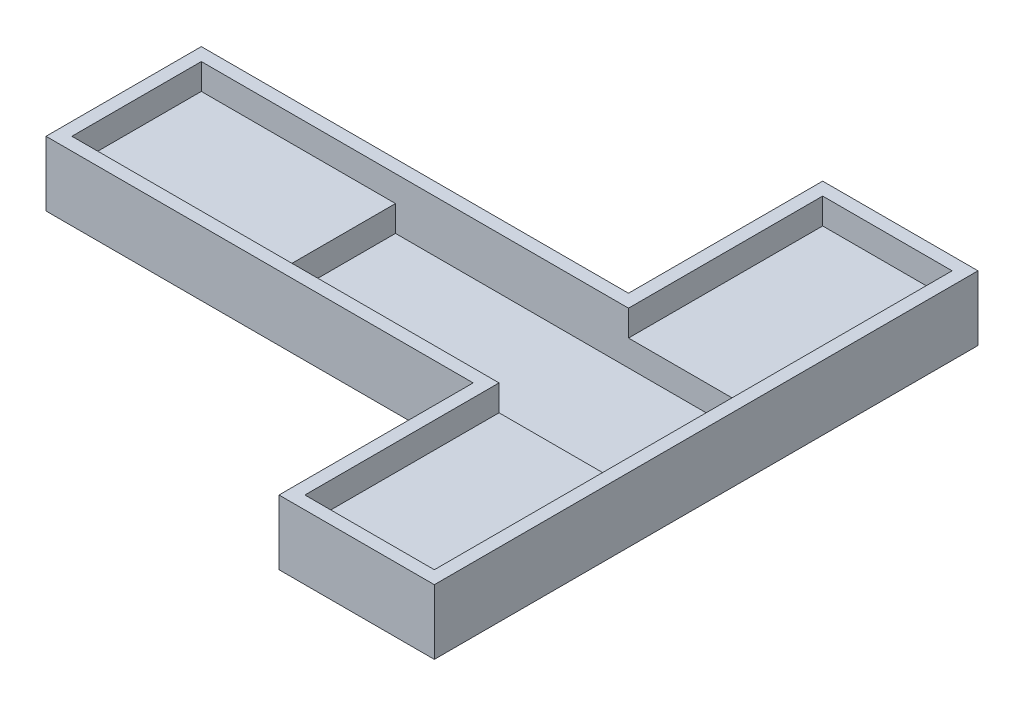
ISO-10303-21;
HEADER;
FILE_DESCRIPTION(('STEP AP214'),'2;1');
FILE_NAME('part.step','',(''),(''),'','','');
FILE_SCHEMA(('AUTOMOTIVE_DESIGN { 1 0 10303 214 1 1 1 1 }'));
ENDSEC;
DATA;
#1=APPLICATION_CONTEXT('core data for automotive mechanical design processes');
#2=APPLICATION_PROTOCOL_DEFINITION('international standard','automotive_design',2000,#1);
#3=PRODUCT_CONTEXT('',#1,'mechanical');
#4=PRODUCT('Part','Part','',(#3));
#5=PRODUCT_RELATED_PRODUCT_CATEGORY('part','',(#4));
#6=PRODUCT_DEFINITION_FORMATION('','',#4);
#7=PRODUCT_DEFINITION_CONTEXT('part definition',#1,'design');
#8=PRODUCT_DEFINITION('design','',#6,#7);
#9=PRODUCT_DEFINITION_SHAPE('','',#8);
#10=(LENGTH_UNIT() NAMED_UNIT(*) SI_UNIT(.MILLI.,.METRE.));
#11=(NAMED_UNIT(*) PLANE_ANGLE_UNIT() SI_UNIT($,.RADIAN.));
#12=(NAMED_UNIT(*) SI_UNIT($,.STERADIAN.) SOLID_ANGLE_UNIT());
#13=UNCERTAINTY_MEASURE_WITH_UNIT(LENGTH_MEASURE(1.E-05),#10,'distance_accuracy_value','');
#14=(GEOMETRIC_REPRESENTATION_CONTEXT(3) GLOBAL_UNCERTAINTY_ASSIGNED_CONTEXT((#13)) GLOBAL_UNIT_ASSIGNED_CONTEXT((#10,
#11,#12)) REPRESENTATION_CONTEXT('',''));
#15=CARTESIAN_POINT('',(0.,0.,0.));
#16=DIRECTION('',(0.,0.,1.));
#17=DIRECTION('',(1.,0.,0.));
#18=AXIS2_PLACEMENT_3D('',#15,#16,#17);
#19=CARTESIAN_POINT('',(0.,1.,0.));
#20=DIRECTION('',(0.,1.,0.));
#21=DIRECTION('',(0.,0.,1.));
#22=AXIS2_PLACEMENT_3D('',#19,#20,#21);
#23=PLANE('',#22);
#24=DIRECTION('',(1.,0.,0.));
#25=VECTOR('',#24,1.);
#26=CARTESIAN_POINT('',(0.,1.,5.));
#27=LINE('',#26,#25);
#28=CARTESIAN_POINT('',(-14.,1.,5.));
#29=VERTEX_POINT('',#28);
#30=CARTESIAN_POINT('',(14.,1.,5.));
#31=VERTEX_POINT('',#30);
#32=EDGE_CURVE('E11',#29,#31,#27,.T.);
#33=ORIENTED_EDGE('',*,*,#32,.T.);
#34=DIRECTION('',(0.,0.,1.));
#35=VECTOR('',#34,1.);
#36=CARTESIAN_POINT('',(14.,1.,0.));
#37=LINE('',#36,#35);
#38=CARTESIAN_POINT('',(14.,1.,-5.));
#39=VERTEX_POINT('',#38);
#40=EDGE_CURVE('E236',#39,#31,#37,.T.);
#41=ORIENTED_EDGE('',*,*,#40,.F.);
#42=DIRECTION('',(1.,0.,0.));
#43=VECTOR('',#42,1.);
#44=CARTESIAN_POINT('',(0.,1.,-4.99999999999999));
#45=LINE('',#44,#43);
#46=CARTESIAN_POINT('',(-14.,1.,-4.99999999999999));
#47=VERTEX_POINT('',#46);
#48=EDGE_CURVE('E45',#47,#39,#45,.T.);
#49=ORIENTED_EDGE('',*,*,#48,.F.);
#50=DIRECTION('',(0.,0.,-1.));
#51=VECTOR('',#50,1.);
#52=CARTESIAN_POINT('',(-14.,1.,-4.99999999999999));
#53=LINE('',#52,#51);
#54=EDGE_CURVE('E269',#29,#47,#53,.T.);
#55=ORIENTED_EDGE('',*,*,#54,.F.);
#56=EDGE_LOOP('',(#33,#41,#49,#55));
#57=FACE_BOUND('',#56,.T.);
#58=ADVANCED_FACE('F37',(#57),#23,.T.);
#59=CARTESIAN_POINT('',(14.,0.,20.));
#60=DIRECTION('',(1.,0.,0.));
#61=DIRECTION('',(0.,0.,-1.));
#62=AXIS2_PLACEMENT_3D('',#59,#60,#61);
#63=PLANE('',#62);
#64=DIRECTION('',(0.,-1.,0.));
#65=VECTOR('',#64,1.);
#66=CARTESIAN_POINT('',(14.,3.,5.));
#67=LINE('',#66,#65);
#68=CARTESIAN_POINT('',(14.,3.,5.));
#69=VERTEX_POINT('',#68);
#70=EDGE_CURVE('E276',#69,#31,#67,.T.);
#71=ORIENTED_EDGE('',*,*,#70,.F.);
#72=DIRECTION('',(0.,0.,-1.));
#73=VECTOR('',#72,1.);
#74=CARTESIAN_POINT('',(14.,3.,5.));
#75=LINE('',#74,#73);
#76=CARTESIAN_POINT('',(14.,3.,20.));
#77=VERTEX_POINT('',#76);
#78=EDGE_CURVE('E186',#77,#69,#75,.T.);
#79=ORIENTED_EDGE('',*,*,#78,.F.);
#80=DIRECTION('',(0.,1.,0.));
#81=VECTOR('',#80,1.);
#82=CARTESIAN_POINT('',(14.,0.,20.));
#83=LINE('',#82,#81);
#84=CARTESIAN_POINT('',(14.,5.,20.));
#85=VERTEX_POINT('',#84);
#86=EDGE_CURVE('E185',#77,#85,#83,.T.);
#87=ORIENTED_EDGE('',*,*,#86,.T.);
#88=DIRECTION('',(0.,0.,-1.));
#89=VECTOR('',#88,1.);
#90=CARTESIAN_POINT('',(14.,5.,20.));
#91=LINE('',#90,#89);
#92=CARTESIAN_POINT('',(14.,5.,-20.));
#93=VERTEX_POINT('',#92);
#94=EDGE_CURVE('E305',#85,#93,#91,.T.);
#95=ORIENTED_EDGE('',*,*,#94,.T.);
#96=DIRECTION('',(0.,1.,0.));
#97=VECTOR('',#96,1.);
#98=CARTESIAN_POINT('',(14.,0.,-20.));
#99=LINE('',#98,#97);
#100=CARTESIAN_POINT('',(14.,3.,-20.));
#101=VERTEX_POINT('',#100);
#102=EDGE_CURVE('E210',#101,#93,#99,.T.);
#103=ORIENTED_EDGE('',*,*,#102,.F.);
#104=DIRECTION('',(0.,0.,-1.));
#105=VECTOR('',#104,1.);
#106=CARTESIAN_POINT('',(14.,3.,-5.));
#107=LINE('',#106,#105);
#108=CARTESIAN_POINT('',(14.,3.,-5.));
#109=VERTEX_POINT('',#108);
#110=EDGE_CURVE('E267',#109,#101,#107,.T.);
#111=ORIENTED_EDGE('',*,*,#110,.F.);
#112=DIRECTION('',(0.,-1.,0.));
#113=VECTOR('',#112,1.);
#114=CARTESIAN_POINT('',(14.,3.,-5.));
#115=LINE('',#114,#113);
#116=EDGE_CURVE('E257',#109,#39,#115,.T.);
#117=ORIENTED_EDGE('',*,*,#116,.T.);
#118=ORIENTED_EDGE('',*,*,#40,.T.);
#119=EDGE_LOOP('',(#71,#79,#87,#95,#103,#111,#117,#118));
#120=FACE_BOUND('',#119,.T.);
#121=ADVANCED_FACE('F265',(#120),#63,.F.);
#122=CARTESIAN_POINT('',(3.99999999999999,0.,-20.));
#123=DIRECTION('',(-1.,0.,0.));
#124=DIRECTION('',(0.,0.,1.));
#125=AXIS2_PLACEMENT_3D('',#122,#123,#124);
#126=PLANE('',#125);
#127=DIRECTION('',(0.,0.,1.));
#128=VECTOR('',#127,1.);
#129=CARTESIAN_POINT('',(3.99999999999999,3.,-5.));
#130=LINE('',#129,#128);
#131=CARTESIAN_POINT('',(3.99999999999999,3.,-20.));
#132=VERTEX_POINT('',#131);
#133=CARTESIAN_POINT('',(3.99999999999999,3.,-4.99999999999999));
#134=VERTEX_POINT('',#133);
#135=EDGE_CURVE('E278',#132,#134,#130,.T.);
#136=ORIENTED_EDGE('',*,*,#135,.F.);
#137=DIRECTION('',(0.,1.,0.));
#138=VECTOR('',#137,1.);
#139=CARTESIAN_POINT('',(3.99999999999999,0.,-20.));
#140=LINE('',#139,#138);
#141=CARTESIAN_POINT('',(3.99999999999999,5.,-20.));
#142=VERTEX_POINT('',#141);
#143=EDGE_CURVE('E208',#132,#142,#140,.T.);
#144=ORIENTED_EDGE('',*,*,#143,.T.);
#145=DIRECTION('',(0.,0.,1.));
#146=VECTOR('',#145,1.);
#147=CARTESIAN_POINT('',(3.99999999999999,5.,-20.));
#148=LINE('',#147,#146);
#149=CARTESIAN_POINT('',(3.99999999999999,5.,-4.99999999999999));
#150=VERTEX_POINT('',#149);
#151=EDGE_CURVE('E311',#142,#150,#148,.T.);
#152=ORIENTED_EDGE('',*,*,#151,.T.);
#153=DIRECTION('',(0.,1.,0.));
#154=VECTOR('',#153,1.);
#155=CARTESIAN_POINT('',(3.99999999999999,0.,-4.99999999999999));
#156=LINE('',#155,#154);
#157=EDGE_CURVE('E60',#134,#150,#156,.T.);
#158=ORIENTED_EDGE('',*,*,#157,.F.);
#159=EDGE_LOOP('',(#136,#144,#152,#158));
#160=FACE_BOUND('',#159,.T.);
#161=ADVANCED_FACE('F392',(#160),#126,.F.);
#162=CARTESIAN_POINT('',(14.,0.,-20.));
#163=DIRECTION('',(0.,0.,-1.));
#164=DIRECTION('',(-1.,0.,0.));
#165=AXIS2_PLACEMENT_3D('',#162,#163,#164);
#166=PLANE('',#165);
#167=DIRECTION('',(-1.,0.,0.));
#168=VECTOR('',#167,1.);
#169=CARTESIAN_POINT('',(3.99999999999999,3.,-20.));
#170=LINE('',#169,#168);
#171=EDGE_CURVE('E270',#101,#132,#170,.T.);
#172=ORIENTED_EDGE('',*,*,#171,.F.);
#173=ORIENTED_EDGE('',*,*,#102,.T.);
#174=DIRECTION('',(-1.,0.,0.));
#175=VECTOR('',#174,1.);
#176=CARTESIAN_POINT('',(14.,5.,-20.));
#177=LINE('',#176,#175);
#178=EDGE_CURVE('E308',#93,#142,#177,.T.);
#179=ORIENTED_EDGE('',*,*,#178,.T.);
#180=ORIENTED_EDGE('',*,*,#143,.F.);
#181=EDGE_LOOP('',(#172,#173,#179,#180));
#182=FACE_BOUND('',#181,.T.);
#183=ADVANCED_FACE('F511',(#182),#166,.F.);
#184=CARTESIAN_POINT('',(-29.,0.,5.));
#185=DIRECTION('',(0.,0.,1.));
#186=DIRECTION('',(1.,0.,0.));
#187=AXIS2_PLACEMENT_3D('',#184,#185,#186);
#188=PLANE('',#187);
#189=DIRECTION('',(0.,-1.,0.));
#190=VECTOR('',#189,1.);
#191=CARTESIAN_POINT('',(-14.,3.,5.));
#192=LINE('',#191,#190);
#193=CARTESIAN_POINT('',(-14.,3.,5.));
#194=VERTEX_POINT('',#193);
#195=EDGE_CURVE('E301',#194,#29,#192,.T.);
#196=ORIENTED_EDGE('',*,*,#195,.F.);
#197=DIRECTION('',(1.,0.,0.));
#198=VECTOR('',#197,1.);
#199=CARTESIAN_POINT('',(-29.,3.,5.));
#200=LINE('',#199,#198);
#201=CARTESIAN_POINT('',(-29.,3.,5.));
#202=VERTEX_POINT('',#201);
#203=EDGE_CURVE('E292',#202,#194,#200,.T.);
#204=ORIENTED_EDGE('',*,*,#203,.F.);
#205=DIRECTION('',(0.,1.,0.));
#206=VECTOR('',#205,1.);
#207=CARTESIAN_POINT('',(-29.,0.,5.));
#208=LINE('',#207,#206);
#209=CARTESIAN_POINT('',(-29.,5.,5.));
#210=VERTEX_POINT('',#209);
#211=EDGE_CURVE('E198',#202,#210,#208,.T.);
#212=ORIENTED_EDGE('',*,*,#211,.T.);
#213=DIRECTION('',(1.,0.,0.));
#214=VECTOR('',#213,1.);
#215=CARTESIAN_POINT('',(-29.,5.,5.));
#216=LINE('',#215,#214);
#217=CARTESIAN_POINT('',(3.99999999999999,5.,5.));
#218=VERTEX_POINT('',#217);
#219=EDGE_CURVE('E319',#210,#218,#216,.T.);
#220=ORIENTED_EDGE('',*,*,#219,.T.);
#221=DIRECTION('',(0.,1.,0.));
#222=VECTOR('',#221,1.);
#223=CARTESIAN_POINT('',(3.99999999999999,0.,5.));
#224=LINE('',#223,#222);
#225=CARTESIAN_POINT('',(3.99999999999999,3.,5.));
#226=VERTEX_POINT('',#225);
#227=EDGE_CURVE('E193',#226,#218,#224,.T.);
#228=ORIENTED_EDGE('',*,*,#227,.F.);
#229=DIRECTION('',(-1.,0.,0.));
#230=VECTOR('',#229,1.);
#231=CARTESIAN_POINT('',(3.99999999999999,3.,5.));
#232=LINE('',#231,#230);
#233=EDGE_CURVE('E52',#69,#226,#232,.T.);
#234=ORIENTED_EDGE('',*,*,#233,.F.);
#235=ORIENTED_EDGE('',*,*,#70,.T.);
#236=ORIENTED_EDGE('',*,*,#32,.F.);
#237=EDGE_LOOP('',(#196,#204,#212,#220,#228,#234,#235,#236));
#238=FACE_BOUND('',#237,.T.);
#239=ADVANCED_FACE('F277',(#238),#188,.F.);
#240=CARTESIAN_POINT('',(3.99999999999999,0.,-4.99999999999999));
#241=DIRECTION('',(0.,0.,-1.));
#242=DIRECTION('',(-1.,0.,0.));
#243=AXIS2_PLACEMENT_3D('',#240,#241,#242);
#244=PLANE('',#243);
#245=DIRECTION('',(0.,-1.,0.));
#246=VECTOR('',#245,1.);
#247=CARTESIAN_POINT('',(-14.,3.,-4.99999999999999));
#248=LINE('',#247,#246);
#249=CARTESIAN_POINT('',(-14.,3.,-4.99999999999999));
#250=VERTEX_POINT('',#249);
#251=EDGE_CURVE('E259',#250,#47,#248,.T.);
#252=ORIENTED_EDGE('',*,*,#251,.T.);
#253=ORIENTED_EDGE('',*,*,#48,.T.);
#254=ORIENTED_EDGE('',*,*,#116,.F.);
#255=DIRECTION('',(1.,0.,0.));
#256=VECTOR('',#255,1.);
#257=CARTESIAN_POINT('',(3.99999999999999,3.,-5.));
#258=LINE('',#257,#256);
#259=EDGE_CURVE('E281',#134,#109,#258,.T.);
#260=ORIENTED_EDGE('',*,*,#259,.F.);
#261=ORIENTED_EDGE('',*,*,#157,.T.);
#262=DIRECTION('',(-1.,0.,0.));
#263=VECTOR('',#262,1.);
#264=CARTESIAN_POINT('',(3.99999999999999,5.,-4.99999999999999));
#265=LINE('',#264,#263);
#266=CARTESIAN_POINT('',(-29.,5.,-4.99999999999999));
#267=VERTEX_POINT('',#266);
#268=EDGE_CURVE('E313',#150,#267,#265,.T.);
#269=ORIENTED_EDGE('',*,*,#268,.T.);
#270=DIRECTION('',(0.,1.,0.));
#271=VECTOR('',#270,1.);
#272=CARTESIAN_POINT('',(-29.,0.,-4.99999999999999));
#273=LINE('',#272,#271);
#274=CARTESIAN_POINT('',(-29.,3.,-4.99999999999999));
#275=VERTEX_POINT('',#274);
#276=EDGE_CURVE('E205',#275,#267,#273,.T.);
#277=ORIENTED_EDGE('',*,*,#276,.F.);
#278=DIRECTION('',(-1.,0.,0.));
#279=VECTOR('',#278,1.);
#280=CARTESIAN_POINT('',(-29.,3.,-4.99999999999999));
#281=LINE('',#280,#279);
#282=EDGE_CURVE('E297',#250,#275,#281,.T.);
#283=ORIENTED_EDGE('',*,*,#282,.F.);
#284=EDGE_LOOP('',(#252,#253,#254,#260,#261,#269,#277,#283));
#285=FACE_BOUND('',#284,.T.);
#286=ADVANCED_FACE('F256',(#285),#244,.F.);
#287=CARTESIAN_POINT('',(2.99999999999999,0.,21.));
#288=DIRECTION('',(0.,0.,1.));
#289=DIRECTION('',(1.,0.,0.));
#290=AXIS2_PLACEMENT_3D('',#287,#288,#289);
#291=PLANE('',#290);
#292=DIRECTION('',(0.,1.,0.));
#293=VECTOR('',#292,1.);
#294=CARTESIAN_POINT('',(15.,0.,21.));
#295=LINE('',#294,#293);
#296=CARTESIAN_POINT('',(15.,0.,21.));
#297=VERTEX_POINT('',#296);
#298=CARTESIAN_POINT('',(15.,5.,21.));
#299=VERTEX_POINT('',#298);
#300=EDGE_CURVE('E233',#297,#299,#295,.T.);
#301=ORIENTED_EDGE('',*,*,#300,.T.);
#302=DIRECTION('',(1.,0.,0.));
#303=VECTOR('',#302,1.);
#304=CARTESIAN_POINT('',(2.99999999999999,5.,21.));
#305=LINE('',#304,#303);
#306=CARTESIAN_POINT('',(2.99999999999999,5.,21.));
#307=VERTEX_POINT('',#306);
#308=EDGE_CURVE('E323',#307,#299,#305,.T.);
#309=ORIENTED_EDGE('',*,*,#308,.F.);
#310=DIRECTION('',(0.,1.,0.));
#311=VECTOR('',#310,1.);
#312=CARTESIAN_POINT('',(2.99999999999999,0.,21.));
#313=LINE('',#312,#311);
#314=CARTESIAN_POINT('',(2.99999999999999,0.,21.));
#315=VERTEX_POINT('',#314);
#316=EDGE_CURVE('E234',#315,#307,#313,.T.);
#317=ORIENTED_EDGE('',*,*,#316,.F.);
#318=DIRECTION('',(1.,0.,0.));
#319=VECTOR('',#318,1.);
#320=CARTESIAN_POINT('',(2.99999999999999,0.,21.));
#321=LINE('',#320,#319);
#322=EDGE_CURVE('E192',#315,#297,#321,.T.);
#323=ORIENTED_EDGE('',*,*,#322,.T.);
#324=EDGE_LOOP('',(#301,#309,#317,#323));
#325=FACE_BOUND('',#324,.T.);
#326=ADVANCED_FACE('F351',(#325),#291,.T.);
#327=CARTESIAN_POINT('',(2.99999999999999,0.,6.));
#328=DIRECTION('',(-1.,0.,0.));
#329=DIRECTION('',(0.,0.,1.));
#330=AXIS2_PLACEMENT_3D('',#327,#328,#329);
#331=PLANE('',#330);
#332=ORIENTED_EDGE('',*,*,#316,.T.);
#333=DIRECTION('',(0.,0.,1.));
#334=VECTOR('',#333,1.);
#335=CARTESIAN_POINT('',(2.99999999999999,5.,6.));
#336=LINE('',#335,#334);
#337=CARTESIAN_POINT('',(2.99999999999999,5.,6.));
#338=VERTEX_POINT('',#337);
#339=EDGE_CURVE('E201',#338,#307,#336,.T.);
#340=ORIENTED_EDGE('',*,*,#339,.F.);
#341=DIRECTION('',(0.,1.,0.));
#342=VECTOR('',#341,1.);
#343=CARTESIAN_POINT('',(2.99999999999999,0.,6.));
#344=LINE('',#343,#342);
#345=CARTESIAN_POINT('',(2.99999999999999,0.,6.));
#346=VERTEX_POINT('',#345);
#347=EDGE_CURVE('E237',#346,#338,#344,.T.);
#348=ORIENTED_EDGE('',*,*,#347,.F.);
#349=DIRECTION('',(0.,0.,1.));
#350=VECTOR('',#349,1.);
#351=CARTESIAN_POINT('',(2.99999999999999,0.,6.));
#352=LINE('',#351,#350);
#353=EDGE_CURVE('E230',#346,#315,#352,.T.);
#354=ORIENTED_EDGE('',*,*,#353,.T.);
#355=EDGE_LOOP('',(#332,#340,#348,#354));
#356=FACE_BOUND('',#355,.T.);
#357=ADVANCED_FACE('F378',(#356),#331,.T.);
#358=CARTESIAN_POINT('',(-30.,0.,6.));
#359=DIRECTION('',(0.,0.,1.));
#360=DIRECTION('',(1.,0.,0.));
#361=AXIS2_PLACEMENT_3D('',#358,#359,#360);
#362=PLANE('',#361);
#363=ORIENTED_EDGE('',*,*,#347,.T.);
#364=DIRECTION('',(1.,0.,0.));
#365=VECTOR('',#364,1.);
#366=CARTESIAN_POINT('',(-30.,5.,6.));
#367=LINE('',#366,#365);
#368=CARTESIAN_POINT('',(-30.,5.,6.));
#369=VERTEX_POINT('',#368);
#370=EDGE_CURVE('E340',#369,#338,#367,.T.);
#371=ORIENTED_EDGE('',*,*,#370,.F.);
#372=DIRECTION('',(0.,1.,0.));
#373=VECTOR('',#372,1.);
#374=CARTESIAN_POINT('',(-30.,0.,6.));
#375=LINE('',#374,#373);
#376=CARTESIAN_POINT('',(-30.,0.,6.));
#377=VERTEX_POINT('',#376);
#378=EDGE_CURVE('E239',#377,#369,#375,.T.);
#379=ORIENTED_EDGE('',*,*,#378,.F.);
#380=DIRECTION('',(1.,0.,0.));
#381=VECTOR('',#380,1.);
#382=CARTESIAN_POINT('',(-30.,0.,6.));
#383=LINE('',#382,#381);
#384=EDGE_CURVE('E227',#377,#346,#383,.T.);
#385=ORIENTED_EDGE('',*,*,#384,.T.);
#386=EDGE_LOOP('',(#363,#371,#379,#385));
#387=FACE_BOUND('',#386,.T.);
#388=ADVANCED_FACE('F376',(#387),#362,.T.);
#389=CARTESIAN_POINT('',(-30.,0.,-5.99999999999999));
#390=DIRECTION('',(-1.,0.,0.));
#391=DIRECTION('',(0.,0.,1.));
#392=AXIS2_PLACEMENT_3D('',#389,#390,#391);
#393=PLANE('',#392);
#394=ORIENTED_EDGE('',*,*,#378,.T.);
#395=DIRECTION('',(0.,0.,1.));
#396=VECTOR('',#395,1.);
#397=CARTESIAN_POINT('',(-30.,5.,-5.99999999999999));
#398=LINE('',#397,#396);
#399=CARTESIAN_POINT('',(-30.,5.,-5.99999999999999));
#400=VERTEX_POINT('',#399);
#401=EDGE_CURVE('E338',#400,#369,#398,.T.);
#402=ORIENTED_EDGE('',*,*,#401,.F.);
#403=DIRECTION('',(0.,1.,0.));
#404=VECTOR('',#403,1.);
#405=CARTESIAN_POINT('',(-30.,0.,-5.99999999999999));
#406=LINE('',#405,#404);
#407=CARTESIAN_POINT('',(-30.,0.,-5.99999999999999));
#408=VERTEX_POINT('',#407);
#409=EDGE_CURVE('E241',#408,#400,#406,.T.);
#410=ORIENTED_EDGE('',*,*,#409,.F.);
#411=DIRECTION('',(0.,0.,1.));
#412=VECTOR('',#411,1.);
#413=CARTESIAN_POINT('',(-30.,0.,-5.99999999999999));
#414=LINE('',#413,#412);
#415=EDGE_CURVE('E224',#408,#377,#414,.T.);
#416=ORIENTED_EDGE('',*,*,#415,.T.);
#417=EDGE_LOOP('',(#394,#402,#410,#416));
#418=FACE_BOUND('',#417,.T.);
#419=ADVANCED_FACE('F374',(#418),#393,.T.);
#420=CARTESIAN_POINT('',(2.99999999999999,0.,-5.99999999999999));
#421=DIRECTION('',(0.,0.,-1.));
#422=DIRECTION('',(-1.,0.,0.));
#423=AXIS2_PLACEMENT_3D('',#420,#421,#422);
#424=PLANE('',#423);
#425=ORIENTED_EDGE('',*,*,#409,.T.);
#426=DIRECTION('',(-1.,0.,0.));
#427=VECTOR('',#426,1.);
#428=CARTESIAN_POINT('',(2.99999999999999,5.,-5.99999999999999));
#429=LINE('',#428,#427);
#430=CARTESIAN_POINT('',(2.99999999999999,5.,-5.99999999999999));
#431=VERTEX_POINT('',#430);
#432=EDGE_CURVE('E335',#431,#400,#429,.T.);
#433=ORIENTED_EDGE('',*,*,#432,.F.);
#434=DIRECTION('',(0.,1.,0.));
#435=VECTOR('',#434,1.);
#436=CARTESIAN_POINT('',(2.99999999999999,0.,-5.99999999999999));
#437=LINE('',#436,#435);
#438=CARTESIAN_POINT('',(2.99999999999999,0.,-5.99999999999999));
#439=VERTEX_POINT('',#438);
#440=EDGE_CURVE('E243',#439,#431,#437,.T.);
#441=ORIENTED_EDGE('',*,*,#440,.F.);
#442=DIRECTION('',(-1.,0.,0.));
#443=VECTOR('',#442,1.);
#444=CARTESIAN_POINT('',(2.99999999999999,0.,-5.99999999999999));
#445=LINE('',#444,#443);
#446=EDGE_CURVE('E221',#439,#408,#445,.T.);
#447=ORIENTED_EDGE('',*,*,#446,.T.);
#448=EDGE_LOOP('',(#425,#433,#441,#447));
#449=FACE_BOUND('',#448,.T.);
#450=ADVANCED_FACE('F370',(#449),#424,.T.);
#451=CARTESIAN_POINT('',(2.99999999999999,0.,-21.));
#452=DIRECTION('',(-1.,0.,0.));
#453=DIRECTION('',(0.,0.,1.));
#454=AXIS2_PLACEMENT_3D('',#451,#452,#453);
#455=PLANE('',#454);
#456=ORIENTED_EDGE('',*,*,#440,.T.);
#457=DIRECTION('',(0.,0.,1.));
#458=VECTOR('',#457,1.);
#459=CARTESIAN_POINT('',(2.99999999999999,5.,-21.));
#460=LINE('',#459,#458);
#461=CARTESIAN_POINT('',(2.99999999999999,5.,-21.));
#462=VERTEX_POINT('',#461);
#463=EDGE_CURVE('E332',#462,#431,#460,.T.);
#464=ORIENTED_EDGE('',*,*,#463,.F.);
#465=DIRECTION('',(0.,1.,0.));
#466=VECTOR('',#465,1.);
#467=CARTESIAN_POINT('',(2.99999999999999,0.,-21.));
#468=LINE('',#467,#466);
#469=CARTESIAN_POINT('',(2.99999999999999,0.,-21.));
#470=VERTEX_POINT('',#469);
#471=EDGE_CURVE('E245',#470,#462,#468,.T.);
#472=ORIENTED_EDGE('',*,*,#471,.F.);
#473=DIRECTION('',(0.,0.,1.));
#474=VECTOR('',#473,1.);
#475=CARTESIAN_POINT('',(2.99999999999999,0.,-21.));
#476=LINE('',#475,#474);
#477=EDGE_CURVE('E218',#470,#439,#476,.T.);
#478=ORIENTED_EDGE('',*,*,#477,.T.);
#479=EDGE_LOOP('',(#456,#464,#472,#478));
#480=FACE_BOUND('',#479,.T.);
#481=ADVANCED_FACE('F364',(#480),#455,.T.);
#482=CARTESIAN_POINT('',(15.,0.,-21.));
#483=DIRECTION('',(0.,0.,-1.));
#484=DIRECTION('',(-1.,0.,0.));
#485=AXIS2_PLACEMENT_3D('',#482,#483,#484);
#486=PLANE('',#485);
#487=ORIENTED_EDGE('',*,*,#471,.T.);
#488=DIRECTION('',(-1.,0.,0.));
#489=VECTOR('',#488,1.);
#490=CARTESIAN_POINT('',(15.,5.,-21.));
#491=LINE('',#490,#489);
#492=CARTESIAN_POINT('',(15.,5.,-21.));
#493=VERTEX_POINT('',#492);
#494=EDGE_CURVE('E329',#493,#462,#491,.T.);
#495=ORIENTED_EDGE('',*,*,#494,.F.);
#496=DIRECTION('',(0.,1.,0.));
#497=VECTOR('',#496,1.);
#498=CARTESIAN_POINT('',(15.,0.,-21.));
#499=LINE('',#498,#497);
#500=CARTESIAN_POINT('',(15.,0.,-21.));
#501=VERTEX_POINT('',#500);
#502=EDGE_CURVE('E247',#501,#493,#499,.T.);
#503=ORIENTED_EDGE('',*,*,#502,.F.);
#504=DIRECTION('',(-1.,0.,0.));
#505=VECTOR('',#504,1.);
#506=CARTESIAN_POINT('',(15.,0.,-21.));
#507=LINE('',#506,#505);
#508=EDGE_CURVE('E215',#501,#470,#507,.T.);
#509=ORIENTED_EDGE('',*,*,#508,.T.);
#510=EDGE_LOOP('',(#487,#495,#503,#509));
#511=FACE_BOUND('',#510,.T.);
#512=ADVANCED_FACE('F360',(#511),#486,.T.);
#513=CARTESIAN_POINT('',(15.,0.,21.));
#514=DIRECTION('',(1.,0.,0.));
#515=DIRECTION('',(0.,0.,-1.));
#516=AXIS2_PLACEMENT_3D('',#513,#514,#515);
#517=PLANE('',#516);
#518=ORIENTED_EDGE('',*,*,#502,.T.);
#519=DIRECTION('',(0.,0.,-1.));
#520=VECTOR('',#519,1.);
#521=CARTESIAN_POINT('',(15.,5.,21.));
#522=LINE('',#521,#520);
#523=EDGE_CURVE('E326',#299,#493,#522,.T.);
#524=ORIENTED_EDGE('',*,*,#523,.F.);
#525=ORIENTED_EDGE('',*,*,#300,.F.);
#526=DIRECTION('',(0.,0.,-1.));
#527=VECTOR('',#526,1.);
#528=CARTESIAN_POINT('',(15.,0.,21.));
#529=LINE('',#528,#527);
#530=EDGE_CURVE('E196',#297,#501,#529,.T.);
#531=ORIENTED_EDGE('',*,*,#530,.T.);
#532=EDGE_LOOP('',(#518,#524,#525,#531));
#533=FACE_BOUND('',#532,.T.);
#534=ADVANCED_FACE('F356',(#533),#517,.T.);
#535=CARTESIAN_POINT('',(3.99999999999999,0.,20.));
#536=DIRECTION('',(0.,0.,1.));
#537=DIRECTION('',(1.,0.,0.));
#538=AXIS2_PLACEMENT_3D('',#535,#536,#537);
#539=PLANE('',#538);
#540=ORIENTED_EDGE('',*,*,#86,.F.);
#541=DIRECTION('',(1.,0.,0.));
#542=VECTOR('',#541,1.);
#543=CARTESIAN_POINT('',(3.99999999999999,3.,20.));
#544=LINE('',#543,#542);
#545=CARTESIAN_POINT('',(3.99999999999999,3.,20.));
#546=VERTEX_POINT('',#545);
#547=EDGE_CURVE('E173',#546,#77,#544,.T.);
#548=ORIENTED_EDGE('',*,*,#547,.F.);
#549=DIRECTION('',(0.,1.,0.));
#550=VECTOR('',#549,1.);
#551=CARTESIAN_POINT('',(3.99999999999999,0.,20.));
#552=LINE('',#551,#550);
#553=CARTESIAN_POINT('',(3.99999999999999,5.,20.));
#554=VERTEX_POINT('',#553);
#555=EDGE_CURVE('E183',#546,#554,#552,.T.);
#556=ORIENTED_EDGE('',*,*,#555,.T.);
#557=DIRECTION('',(1.,0.,0.));
#558=VECTOR('',#557,1.);
#559=CARTESIAN_POINT('',(3.99999999999999,5.,20.));
#560=LINE('',#559,#558);
#561=EDGE_CURVE('E303',#554,#85,#560,.T.);
#562=ORIENTED_EDGE('',*,*,#561,.T.);
#563=EDGE_LOOP('',(#540,#548,#556,#562));
#564=FACE_BOUND('',#563,.T.);
#565=ADVANCED_FACE('F181',(#564),#539,.F.);
#566=CARTESIAN_POINT('',(3.99999999999999,0.,5.));
#567=DIRECTION('',(-1.,0.,0.));
#568=DIRECTION('',(0.,0.,1.));
#569=AXIS2_PLACEMENT_3D('',#566,#567,#568);
#570=PLANE('',#569);
#571=ORIENTED_EDGE('',*,*,#555,.F.);
#572=DIRECTION('',(0.,0.,1.));
#573=VECTOR('',#572,1.);
#574=CARTESIAN_POINT('',(3.99999999999999,3.,5.));
#575=LINE('',#574,#573);
#576=EDGE_CURVE('E170',#226,#546,#575,.T.);
#577=ORIENTED_EDGE('',*,*,#576,.F.);
#578=ORIENTED_EDGE('',*,*,#227,.T.);
#579=DIRECTION('',(0.,0.,1.));
#580=VECTOR('',#579,1.);
#581=CARTESIAN_POINT('',(3.99999999999999,5.,5.));
#582=LINE('',#581,#580);
#583=EDGE_CURVE('E190',#218,#554,#582,.T.);
#584=ORIENTED_EDGE('',*,*,#583,.T.);
#585=EDGE_LOOP('',(#571,#577,#578,#584));
#586=FACE_BOUND('',#585,.T.);
#587=ADVANCED_FACE('F188',(#586),#570,.F.);
#588=CARTESIAN_POINT('',(-29.,0.,-4.99999999999999));
#589=DIRECTION('',(-1.,0.,0.));
#590=DIRECTION('',(0.,0.,1.));
#591=AXIS2_PLACEMENT_3D('',#588,#589,#590);
#592=PLANE('',#591);
#593=ORIENTED_EDGE('',*,*,#211,.F.);
#594=DIRECTION('',(0.,0.,1.));
#595=VECTOR('',#594,1.);
#596=CARTESIAN_POINT('',(-29.,3.,-4.99999999999999));
#597=LINE('',#596,#595);
#598=EDGE_CURVE('E290',#275,#202,#597,.T.);
#599=ORIENTED_EDGE('',*,*,#598,.F.);
#600=ORIENTED_EDGE('',*,*,#276,.T.);
#601=DIRECTION('',(0.,0.,1.));
#602=VECTOR('',#601,1.);
#603=CARTESIAN_POINT('',(-29.,5.,-4.99999999999999));
#604=LINE('',#603,#602);
#605=EDGE_CURVE('E316',#267,#210,#604,.T.);
#606=ORIENTED_EDGE('',*,*,#605,.T.);
#607=EDGE_LOOP('',(#593,#599,#600,#606));
#608=FACE_BOUND('',#607,.T.);
#609=ADVANCED_FACE('F437',(#608),#592,.F.);
#610=CARTESIAN_POINT('',(0.,5.,0.));
#611=DIRECTION('',(0.,1.,0.));
#612=DIRECTION('',(0.,0.,1.));
#613=AXIS2_PLACEMENT_3D('',#610,#611,#612);
#614=PLANE('',#613);
#615=ORIENTED_EDGE('',*,*,#308,.T.);
#616=ORIENTED_EDGE('',*,*,#523,.T.);
#617=ORIENTED_EDGE('',*,*,#494,.T.);
#618=ORIENTED_EDGE('',*,*,#463,.T.);
#619=ORIENTED_EDGE('',*,*,#432,.T.);
#620=ORIENTED_EDGE('',*,*,#401,.T.);
#621=ORIENTED_EDGE('',*,*,#370,.T.);
#622=ORIENTED_EDGE('',*,*,#339,.T.);
#623=EDGE_LOOP('',(#615,#616,#617,#618,#619,#620,#621,#622));
#624=FACE_BOUND('',#623,.T.);
#625=ORIENTED_EDGE('',*,*,#94,.F.);
#626=ORIENTED_EDGE('',*,*,#561,.F.);
#627=ORIENTED_EDGE('',*,*,#583,.F.);
#628=ORIENTED_EDGE('',*,*,#219,.F.);
#629=ORIENTED_EDGE('',*,*,#605,.F.);
#630=ORIENTED_EDGE('',*,*,#268,.F.);
#631=ORIENTED_EDGE('',*,*,#151,.F.);
#632=ORIENTED_EDGE('',*,*,#178,.F.);
#633=EDGE_LOOP('',(#625,#626,#627,#628,#629,#630,#631,#632));
#634=FACE_BOUND('',#633,.T.);
#635=ADVANCED_FACE('F347',(#624,#634),#614,.T.);
#636=CARTESIAN_POINT('',(0.,0.,0.));
#637=DIRECTION('',(0.,1.,0.));
#638=DIRECTION('',(0.,0.,1.));
#639=AXIS2_PLACEMENT_3D('',#636,#637,#638);
#640=PLANE('',#639);
#641=ORIENTED_EDGE('',*,*,#322,.F.);
#642=ORIENTED_EDGE('',*,*,#353,.F.);
#643=ORIENTED_EDGE('',*,*,#384,.F.);
#644=ORIENTED_EDGE('',*,*,#415,.F.);
#645=ORIENTED_EDGE('',*,*,#446,.F.);
#646=ORIENTED_EDGE('',*,*,#477,.F.);
#647=ORIENTED_EDGE('',*,*,#508,.F.);
#648=ORIENTED_EDGE('',*,*,#530,.F.);
#649=EDGE_LOOP('',(#641,#642,#643,#644,#645,#646,#647,#648));
#650=FACE_BOUND('',#649,.T.);
#651=ADVANCED_FACE('F39',(#650),#640,.F.);
#652=CARTESIAN_POINT('',(-14.,3.,-4.99999999999999));
#653=DIRECTION('',(-1.,0.,0.));
#654=DIRECTION('',(0.,0.,1.));
#655=AXIS2_PLACEMENT_3D('',#652,#653,#654);
#656=PLANE('',#655);
#657=ORIENTED_EDGE('',*,*,#54,.T.);
#658=ORIENTED_EDGE('',*,*,#251,.F.);
#659=DIRECTION('',(0.,0.,-1.));
#660=VECTOR('',#659,1.);
#661=CARTESIAN_POINT('',(-14.,3.,-4.99999999999999));
#662=LINE('',#661,#660);
#663=EDGE_CURVE('E294',#194,#250,#662,.T.);
#664=ORIENTED_EDGE('',*,*,#663,.F.);
#665=ORIENTED_EDGE('',*,*,#195,.T.);
#666=EDGE_LOOP('',(#657,#658,#664,#665));
#667=FACE_BOUND('',#666,.T.);
#668=ADVANCED_FACE('F457',(#667),#656,.F.);
#669=CARTESIAN_POINT('',(0.,3.,0.));
#670=DIRECTION('',(0.,1.,0.));
#671=DIRECTION('',(0.,0.,1.));
#672=AXIS2_PLACEMENT_3D('',#669,#670,#671);
#673=PLANE('',#672);
#674=ORIENTED_EDGE('',*,*,#598,.T.);
#675=ORIENTED_EDGE('',*,*,#203,.T.);
#676=ORIENTED_EDGE('',*,*,#663,.T.);
#677=ORIENTED_EDGE('',*,*,#282,.T.);
#678=EDGE_LOOP('',(#674,#675,#676,#677));
#679=FACE_BOUND('',#678,.T.);
#680=ADVANCED_FACE('F462',(#679),#673,.T.);
#681=CARTESIAN_POINT('',(0.,3.,0.));
#682=DIRECTION('',(0.,-1.,0.));
#683=DIRECTION('',(0.,0.,-1.));
#684=AXIS2_PLACEMENT_3D('',#681,#682,#683);
#685=PLANE('',#684);
#686=ORIENTED_EDGE('',*,*,#135,.T.);
#687=ORIENTED_EDGE('',*,*,#259,.T.);
#688=ORIENTED_EDGE('',*,*,#110,.T.);
#689=ORIENTED_EDGE('',*,*,#171,.T.);
#690=EDGE_LOOP('',(#686,#687,#688,#689));
#691=FACE_BOUND('',#690,.T.);
#692=ADVANCED_FACE('F470',(#691),#685,.F.);
#693=CARTESIAN_POINT('',(0.,3.,0.));
#694=DIRECTION('',(0.,1.,0.));
#695=DIRECTION('',(0.,0.,1.));
#696=AXIS2_PLACEMENT_3D('',#693,#694,#695);
#697=PLANE('',#696);
#698=ORIENTED_EDGE('',*,*,#576,.T.);
#699=ORIENTED_EDGE('',*,*,#547,.T.);
#700=ORIENTED_EDGE('',*,*,#78,.T.);
#701=ORIENTED_EDGE('',*,*,#233,.T.);
#702=EDGE_LOOP('',(#698,#699,#700,#701));
#703=FACE_BOUND('',#702,.T.);
#704=ADVANCED_FACE('F172',(#703),#697,.T.);
#705=CLOSED_SHELL('',(#58,#121,#161,#183,#239,#286,#326,#357,#388,#419,#450,#481,#512,#534,#565,
#587,#609,#635,#651,#668,#680,#692,#704));
#706=MANIFOLD_SOLID_BREP('B2',#705);
#707=ADVANCED_BREP_SHAPE_REPRESENTATION('',(#18,#706),#14);
#708=SHAPE_DEFINITION_REPRESENTATION(#9,#707);
ENDSEC;
END-ISO-10303-21;
